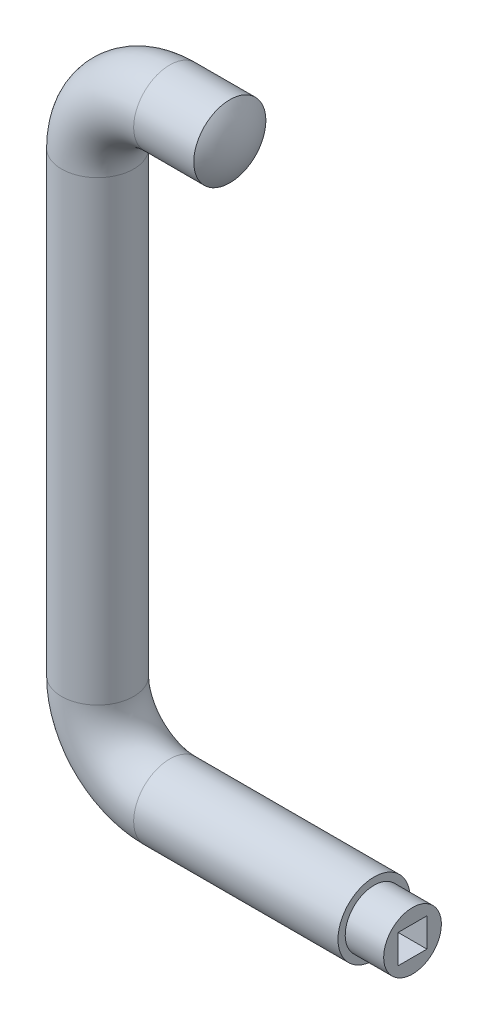
ISO-10303-21;
HEADER;
FILE_DESCRIPTION(('STEP AP214'),'2;1');
FILE_NAME('part.step','',(''),(''),'','','');
FILE_SCHEMA(('AUTOMOTIVE_DESIGN { 1 0 10303 214 1 1 1 1 }'));
ENDSEC;
DATA;
#1=APPLICATION_CONTEXT('core data for automotive mechanical design processes');
#2=APPLICATION_PROTOCOL_DEFINITION('international standard','automotive_design',2000,#1);
#3=PRODUCT_CONTEXT('',#1,'mechanical');
#4=PRODUCT('Part','Part','',(#3));
#5=PRODUCT_RELATED_PRODUCT_CATEGORY('part','',(#4));
#6=PRODUCT_DEFINITION_FORMATION('','',#4);
#7=PRODUCT_DEFINITION_CONTEXT('part definition',#1,'design');
#8=PRODUCT_DEFINITION('design','',#6,#7);
#9=PRODUCT_DEFINITION_SHAPE('','',#8);
#10=(LENGTH_UNIT() NAMED_UNIT(*) SI_UNIT(.MILLI.,.METRE.));
#11=(NAMED_UNIT(*) PLANE_ANGLE_UNIT() SI_UNIT($,.RADIAN.));
#12=(NAMED_UNIT(*) SI_UNIT($,.STERADIAN.) SOLID_ANGLE_UNIT());
#13=UNCERTAINTY_MEASURE_WITH_UNIT(LENGTH_MEASURE(1.E-05),#10,'distance_accuracy_value','');
#14=(GEOMETRIC_REPRESENTATION_CONTEXT(3) GLOBAL_UNCERTAINTY_ASSIGNED_CONTEXT((#13)) GLOBAL_UNIT_ASSIGNED_CONTEXT((#10,
#11,#12)) REPRESENTATION_CONTEXT('',''));
#15=CARTESIAN_POINT('',(0.,0.,0.));
#16=DIRECTION('',(0.,0.,1.));
#17=DIRECTION('',(1.,0.,0.));
#18=AXIS2_PLACEMENT_3D('',#15,#16,#17);
#19=CARTESIAN_POINT('',(-22.,132.5,0.));
#20=DIRECTION('',(1.,0.,0.));
#21=DIRECTION('',(0.,1.,0.));
#22=AXIS2_PLACEMENT_3D('',#19,#20,#21);
#23=PLANE('',#22);
#24=CARTESIAN_POINT('',(-22.,125.,0.));
#25=DIRECTION('',(-1.,0.,0.));
#26=DIRECTION('',(0.,0.,1.));
#27=AXIS2_PLACEMENT_3D('',#24,#25,#26);
#28=CIRCLE('',#27,6.);
#29=CARTESIAN_POINT('',(-22.,125.,6.));
#30=VERTEX_POINT('',#29);
#31=EDGE_CURVE('E145',#30,#30,#28,.T.);
#32=ORIENTED_EDGE('',*,*,#31,.T.);
#33=EDGE_LOOP('',(#32));
#34=FACE_BOUND('',#33,.T.);
#35=ADVANCED_FACE('F45',(#34),#23,.F.);
#36=CARTESIAN_POINT('',(-34.5,125.,0.));
#37=DIRECTION('',(1.,0.,0.));
#38=DIRECTION('',(0.,0.,-1.));
#39=AXIS2_PLACEMENT_3D('',#36,#37,#38);
#40=CYLINDRICAL_SURFACE('',#39,6.);
#41=ORIENTED_EDGE('',*,*,#31,.F.);
#42=EDGE_LOOP('',(#41));
#43=FACE_BOUND('',#42,.T.);
#44=CARTESIAN_POINT('',(-34.5,125.,0.));
#45=DIRECTION('',(-1.,0.,0.));
#46=DIRECTION('',(0.,-1.,0.));
#47=AXIS2_PLACEMENT_3D('',#44,#45,#46);
#48=CIRCLE('',#47,6.);
#49=CARTESIAN_POINT('',(-34.5,131.,0.));
#50=VERTEX_POINT('',#49);
#51=EDGE_CURVE('E142',#50,#50,#48,.T.);
#52=ORIENTED_EDGE('',*,*,#51,.T.);
#53=EDGE_LOOP('',(#52));
#54=FACE_BOUND('',#53,.T.);
#55=ADVANCED_FACE('F181',(#43,#54),#40,.F.);
#56=CARTESIAN_POINT('',(-34.5,110.,0.));
#57=DIRECTION('',(0.,0.,-1.));
#58=DIRECTION('',(-1.,0.,0.));
#59=AXIS2_PLACEMENT_3D('',#56,#57,#58);
#60=TOROIDAL_SURFACE('',#59,15.,6.);
#61=CARTESIAN_POINT('',(-49.5,110.,0.));
#62=DIRECTION('',(0.,1.,0.));
#63=DIRECTION('',(-1.,0.,0.));
#64=AXIS2_PLACEMENT_3D('',#61,#62,#63);
#65=CIRCLE('',#64,6.);
#66=CARTESIAN_POINT('',(-55.5,110.,0.));
#67=VERTEX_POINT('',#66);
#68=EDGE_CURVE('E139',#67,#67,#65,.F.);
#69=CARTESIAN_POINT('',(-34.5,110.,0.));
#70=DIRECTION('',(0.,0.,-1.));
#71=DIRECTION('',(-1.,0.,0.));
#72=AXIS2_PLACEMENT_3D('',#69,#70,#71);
#73=CIRCLE('',#72,21.);
#74=EDGE_CURVE('',#67,#50,#73,.T.);
#75=ORIENTED_EDGE('',*,*,#68,.T.);
#76=ORIENTED_EDGE('',*,*,#51,.F.);
#77=ORIENTED_EDGE('',*,*,#74,.T.);
#78=ORIENTED_EDGE('',*,*,#74,.F.);
#79=EDGE_LOOP('',(#75,#77,#76,#78));
#80=FACE_BOUND('',#79,.T.);
#81=ADVANCED_FACE('F187',(#80),#60,.F.);
#82=CARTESIAN_POINT('',(-49.5,15.,0.));
#83=DIRECTION('',(0.,1.,0.));
#84=DIRECTION('',(-1.,0.,0.));
#85=AXIS2_PLACEMENT_3D('',#82,#83,#84);
#86=CYLINDRICAL_SURFACE('',#85,6.);
#87=ORIENTED_EDGE('',*,*,#68,.F.);
#88=EDGE_LOOP('',(#87));
#89=FACE_BOUND('',#88,.T.);
#90=CARTESIAN_POINT('',(-49.5,15.,0.));
#91=DIRECTION('',(0.,-1.,0.));
#92=DIRECTION('',(1.,0.,0.));
#93=AXIS2_PLACEMENT_3D('',#90,#91,#92);
#94=CIRCLE('',#93,6.);
#95=CARTESIAN_POINT('',(-55.5,15.,0.));
#96=VERTEX_POINT('',#95);
#97=EDGE_CURVE('E136',#96,#96,#94,.T.);
#98=ORIENTED_EDGE('',*,*,#97,.T.);
#99=EDGE_LOOP('',(#98));
#100=FACE_BOUND('',#99,.T.);
#101=ADVANCED_FACE('F200',(#89,#100),#86,.F.);
#102=CARTESIAN_POINT('',(-34.5,15.,0.));
#103=DIRECTION('',(0.,0.,-1.));
#104=DIRECTION('',(-1.,0.,0.));
#105=AXIS2_PLACEMENT_3D('',#102,#103,#104);
#106=TOROIDAL_SURFACE('',#105,15.,6.);
#107=CARTESIAN_POINT('',(-34.5,0.,0.));
#108=DIRECTION('',(-1.,0.,0.));
#109=DIRECTION('',(0.,-1.,0.));
#110=AXIS2_PLACEMENT_3D('',#107,#108,#109);
#111=CIRCLE('',#110,6.);
#112=CARTESIAN_POINT('',(-34.5,-6.,0.));
#113=VERTEX_POINT('',#112);
#114=EDGE_CURVE('E133',#113,#113,#111,.F.);
#115=CARTESIAN_POINT('',(-34.5,15.,0.));
#116=DIRECTION('',(0.,0.,-1.));
#117=DIRECTION('',(-1.,0.,0.));
#118=AXIS2_PLACEMENT_3D('',#115,#116,#117);
#119=CIRCLE('',#118,21.);
#120=EDGE_CURVE('',#113,#96,#119,.T.);
#121=ORIENTED_EDGE('',*,*,#114,.T.);
#122=ORIENTED_EDGE('',*,*,#97,.F.);
#123=ORIENTED_EDGE('',*,*,#120,.T.);
#124=ORIENTED_EDGE('',*,*,#120,.F.);
#125=EDGE_LOOP('',(#121,#123,#122,#124));
#126=FACE_BOUND('',#125,.T.);
#127=ADVANCED_FACE('F196',(#126),#106,.F.);
#128=CARTESIAN_POINT('',(0.,0.,0.));
#129=DIRECTION('',(-1.,0.,0.));
#130=DIRECTION('',(0.,-1.,0.));
#131=AXIS2_PLACEMENT_3D('',#128,#129,#130);
#132=CYLINDRICAL_SURFACE('',#131,6.);
#133=ORIENTED_EDGE('',*,*,#114,.F.);
#134=EDGE_LOOP('',(#133));
#135=FACE_BOUND('',#134,.T.);
#136=CARTESIAN_POINT('',(0.,0.,0.));
#137=DIRECTION('',(1.,0.,0.));
#138=DIRECTION('',(0.,1.,0.));
#139=AXIS2_PLACEMENT_3D('',#136,#137,#138);
#140=CIRCLE('',#139,6.);
#141=CARTESIAN_POINT('',(0.,6.,0.));
#142=VERTEX_POINT('',#141);
#143=EDGE_CURVE('E129',#142,#142,#140,.T.);
#144=ORIENTED_EDGE('',*,*,#143,.T.);
#145=EDGE_LOOP('',(#144));
#146=FACE_BOUND('',#145,.T.);
#147=ADVANCED_FACE('F193',(#135,#146),#132,.F.);
#148=CARTESIAN_POINT('',(0.,0.,0.));
#149=DIRECTION('',(1.,0.,0.));
#150=DIRECTION('',(0.,1.,0.));
#151=AXIS2_PLACEMENT_3D('',#148,#149,#150);
#152=PLANE('',#151);
#153=DIRECTION('',(0.,0.,1.));
#154=VECTOR('',#153,1.);
#155=CARTESIAN_POINT('',(0.,3.,-3.));
#156=LINE('',#155,#154);
#157=CARTESIAN_POINT('',(0.,3.,-3.));
#158=VERTEX_POINT('',#157);
#159=CARTESIAN_POINT('',(0.,3.,3.));
#160=VERTEX_POINT('',#159);
#161=EDGE_CURVE('E95',#158,#160,#156,.T.);
#162=ORIENTED_EDGE('',*,*,#161,.T.);
#163=DIRECTION('',(0.,-1.,0.));
#164=VECTOR('',#163,1.);
#165=CARTESIAN_POINT('',(0.,-3.,3.));
#166=LINE('',#165,#164);
#167=CARTESIAN_POINT('',(0.,-3.,3.));
#168=VERTEX_POINT('',#167);
#169=EDGE_CURVE('E89',#160,#168,#166,.T.);
#170=ORIENTED_EDGE('',*,*,#169,.T.);
#171=DIRECTION('',(0.,0.,-1.));
#172=VECTOR('',#171,1.);
#173=CARTESIAN_POINT('',(0.,-3.,-3.));
#174=LINE('',#173,#172);
#175=CARTESIAN_POINT('',(0.,-3.,-3.));
#176=VERTEX_POINT('',#175);
#177=EDGE_CURVE('E98',#168,#176,#174,.T.);
#178=ORIENTED_EDGE('',*,*,#177,.T.);
#179=DIRECTION('',(0.,1.,0.));
#180=VECTOR('',#179,1.);
#181=CARTESIAN_POINT('',(0.,-3.,-3.));
#182=LINE('',#181,#180);
#183=EDGE_CURVE('E61',#176,#158,#182,.T.);
#184=ORIENTED_EDGE('',*,*,#183,.T.);
#185=EDGE_LOOP('',(#162,#170,#178,#184));
#186=FACE_BOUND('',#185,.T.);
#187=ORIENTED_EDGE('',*,*,#143,.F.);
#188=EDGE_LOOP('',(#187));
#189=FACE_BOUND('',#188,.T.);
#190=ADVANCED_FACE('F102',(#186,#189),#152,.F.);
#191=CARTESIAN_POINT('',(0.,-3.,3.));
#192=DIRECTION('',(0.,0.,1.));
#193=DIRECTION('',(1.,0.,0.));
#194=AXIS2_PLACEMENT_3D('',#191,#192,#193);
#195=PLANE('',#194);
#196=DIRECTION('',(0.,-1.,0.));
#197=VECTOR('',#196,1.);
#198=CARTESIAN_POINT('',(16.,-3.,3.));
#199=LINE('',#198,#197);
#200=CARTESIAN_POINT('',(16.,3.,3.));
#201=VERTEX_POINT('',#200);
#202=CARTESIAN_POINT('',(16.,-3.,3.));
#203=VERTEX_POINT('',#202);
#204=EDGE_CURVE('E69',#201,#203,#199,.T.);
#205=ORIENTED_EDGE('',*,*,#204,.T.);
#206=DIRECTION('',(1.,0.,0.));
#207=VECTOR('',#206,1.);
#208=CARTESIAN_POINT('',(0.,-3.,3.));
#209=LINE('',#208,#207);
#210=EDGE_CURVE('E85',#168,#203,#209,.T.);
#211=ORIENTED_EDGE('',*,*,#210,.F.);
#212=ORIENTED_EDGE('',*,*,#169,.F.);
#213=DIRECTION('',(1.,0.,0.));
#214=VECTOR('',#213,1.);
#215=CARTESIAN_POINT('',(0.,3.,3.));
#216=LINE('',#215,#214);
#217=EDGE_CURVE('E118',#160,#201,#216,.T.);
#218=ORIENTED_EDGE('',*,*,#217,.T.);
#219=EDGE_LOOP('',(#205,#211,#212,#218));
#220=FACE_BOUND('',#219,.T.);
#221=ADVANCED_FACE('F87',(#220),#195,.F.);
#222=CARTESIAN_POINT('',(0.,3.,-3.));
#223=DIRECTION('',(0.,1.,0.));
#224=DIRECTION('',(0.,0.,1.));
#225=AXIS2_PLACEMENT_3D('',#222,#223,#224);
#226=PLANE('',#225);
#227=DIRECTION('',(0.,0.,1.));
#228=VECTOR('',#227,1.);
#229=CARTESIAN_POINT('',(16.,3.,-3.));
#230=LINE('',#229,#228);
#231=CARTESIAN_POINT('',(16.,3.,-3.));
#232=VERTEX_POINT('',#231);
#233=EDGE_CURVE('E105',#232,#201,#230,.T.);
#234=ORIENTED_EDGE('',*,*,#233,.T.);
#235=ORIENTED_EDGE('',*,*,#217,.F.);
#236=ORIENTED_EDGE('',*,*,#161,.F.);
#237=DIRECTION('',(1.,0.,0.));
#238=VECTOR('',#237,1.);
#239=CARTESIAN_POINT('',(0.,3.,-3.));
#240=LINE('',#239,#238);
#241=EDGE_CURVE('E121',#158,#232,#240,.T.);
#242=ORIENTED_EDGE('',*,*,#241,.T.);
#243=EDGE_LOOP('',(#234,#235,#236,#242));
#244=FACE_BOUND('',#243,.T.);
#245=ADVANCED_FACE('F240',(#244),#226,.F.);
#246=CARTESIAN_POINT('',(0.,-3.,-3.));
#247=DIRECTION('',(0.,0.,-1.));
#248=DIRECTION('',(-1.,0.,0.));
#249=AXIS2_PLACEMENT_3D('',#246,#247,#248);
#250=PLANE('',#249);
#251=DIRECTION('',(0.,1.,0.));
#252=VECTOR('',#251,1.);
#253=CARTESIAN_POINT('',(16.,-3.,-3.));
#254=LINE('',#253,#252);
#255=CARTESIAN_POINT('',(16.,-3.,-3.));
#256=VERTEX_POINT('',#255);
#257=EDGE_CURVE('E108',#256,#232,#254,.T.);
#258=ORIENTED_EDGE('',*,*,#257,.T.);
#259=ORIENTED_EDGE('',*,*,#241,.F.);
#260=ORIENTED_EDGE('',*,*,#183,.F.);
#261=DIRECTION('',(1.,0.,0.));
#262=VECTOR('',#261,1.);
#263=CARTESIAN_POINT('',(0.,-3.,-3.));
#264=LINE('',#263,#262);
#265=EDGE_CURVE('E94',#176,#256,#264,.T.);
#266=ORIENTED_EDGE('',*,*,#265,.T.);
#267=EDGE_LOOP('',(#258,#259,#260,#266));
#268=FACE_BOUND('',#267,.T.);
#269=ADVANCED_FACE('F178',(#268),#250,.F.);
#270=CARTESIAN_POINT('',(0.,-3.,-3.));
#271=DIRECTION('',(0.,-1.,0.));
#272=DIRECTION('',(0.,0.,-1.));
#273=AXIS2_PLACEMENT_3D('',#270,#271,#272);
#274=PLANE('',#273);
#275=DIRECTION('',(0.,0.,-1.));
#276=VECTOR('',#275,1.);
#277=CARTESIAN_POINT('',(16.,-3.,-3.));
#278=LINE('',#277,#276);
#279=EDGE_CURVE('E114',#203,#256,#278,.T.);
#280=ORIENTED_EDGE('',*,*,#279,.T.);
#281=ORIENTED_EDGE('',*,*,#265,.F.);
#282=ORIENTED_EDGE('',*,*,#177,.F.);
#283=ORIENTED_EDGE('',*,*,#210,.T.);
#284=EDGE_LOOP('',(#280,#281,#282,#283));
#285=FACE_BOUND('',#284,.T.);
#286=ADVANCED_FACE('F99',(#285),#274,.F.);
#287=CARTESIAN_POINT('',(0.,0.,0.));
#288=DIRECTION('',(-1.,0.,0.));
#289=DIRECTION('',(0.,-1.,0.));
#290=AXIS2_PLACEMENT_3D('',#287,#288,#289);
#291=CYLINDRICAL_SURFACE('',#290,7.5);
#292=CARTESIAN_POINT('',(-34.5,0.,0.));
#293=DIRECTION('',(1.,0.,0.));
#294=DIRECTION('',(0.,0.,1.));
#295=AXIS2_PLACEMENT_3D('',#292,#293,#294);
#296=CIRCLE('',#295,7.5);
#297=CARTESIAN_POINT('',(-34.5,-7.5,0.));
#298=VERTEX_POINT('',#297);
#299=EDGE_CURVE('E150',#298,#298,#296,.T.);
#300=ORIENTED_EDGE('',*,*,#299,.T.);
#301=EDGE_LOOP('',(#300));
#302=FACE_BOUND('',#301,.T.);
#303=CARTESIAN_POINT('',(8.,0.,0.));
#304=DIRECTION('',(1.,0.,0.));
#305=DIRECTION('',(0.,1.,0.));
#306=AXIS2_PLACEMENT_3D('',#303,#304,#305);
#307=CIRCLE('',#306,7.5);
#308=CARTESIAN_POINT('',(8.,7.5,0.));
#309=VERTEX_POINT('',#308);
#310=EDGE_CURVE('E125',#309,#309,#307,.T.);
#311=ORIENTED_EDGE('',*,*,#310,.F.);
#312=EDGE_LOOP('',(#311));
#313=FACE_BOUND('',#312,.T.);
#314=ADVANCED_FACE('F175',(#302,#313),#291,.T.);
#315=CARTESIAN_POINT('',(-34.5,15.,0.));
#316=DIRECTION('',(0.,0.,-1.));
#317=DIRECTION('',(-1.,0.,0.));
#318=AXIS2_PLACEMENT_3D('',#315,#316,#317);
#319=TOROIDAL_SURFACE('',#318,15.,7.5);
#320=CARTESIAN_POINT('',(-49.5,15.,0.));
#321=DIRECTION('',(0.,-1.,0.));
#322=DIRECTION('',(0.,0.,1.));
#323=AXIS2_PLACEMENT_3D('',#320,#321,#322);
#324=CIRCLE('',#323,7.5);
#325=CARTESIAN_POINT('',(-57.,15.,0.));
#326=VERTEX_POINT('',#325);
#327=EDGE_CURVE('E153',#326,#326,#324,.T.);
#328=CARTESIAN_POINT('',(-34.5,15.,0.));
#329=DIRECTION('',(0.,0.,-1.));
#330=DIRECTION('',(-1.,0.,0.));
#331=AXIS2_PLACEMENT_3D('',#328,#329,#330);
#332=CIRCLE('',#331,22.5);
#333=EDGE_CURVE('',#298,#326,#332,.T.);
#334=ORIENTED_EDGE('',*,*,#299,.F.);
#335=ORIENTED_EDGE('',*,*,#327,.T.);
#336=ORIENTED_EDGE('',*,*,#333,.T.);
#337=ORIENTED_EDGE('',*,*,#333,.F.);
#338=EDGE_LOOP('',(#334,#336,#335,#337));
#339=FACE_BOUND('',#338,.T.);
#340=ADVANCED_FACE('F210',(#339),#319,.T.);
#341=CARTESIAN_POINT('',(-49.5,15.,0.));
#342=DIRECTION('',(0.,1.,0.));
#343=DIRECTION('',(-1.,0.,0.));
#344=AXIS2_PLACEMENT_3D('',#341,#342,#343);
#345=CYLINDRICAL_SURFACE('',#344,7.5);
#346=CARTESIAN_POINT('',(-49.5,110.,0.));
#347=DIRECTION('',(0.,-1.,0.));
#348=DIRECTION('',(0.,0.,1.));
#349=AXIS2_PLACEMENT_3D('',#346,#347,#348);
#350=CIRCLE('',#349,7.5);
#351=CARTESIAN_POINT('',(-57.,110.,0.));
#352=VERTEX_POINT('',#351);
#353=EDGE_CURVE('E155',#352,#352,#350,.T.);
#354=ORIENTED_EDGE('',*,*,#353,.T.);
#355=EDGE_LOOP('',(#354));
#356=FACE_BOUND('',#355,.T.);
#357=ORIENTED_EDGE('',*,*,#327,.F.);
#358=EDGE_LOOP('',(#357));
#359=FACE_BOUND('',#358,.T.);
#360=ADVANCED_FACE('F176',(#356,#359),#345,.T.);
#361=CARTESIAN_POINT('',(-34.5,110.,0.));
#362=DIRECTION('',(0.,0.,-1.));
#363=DIRECTION('',(-1.,0.,0.));
#364=AXIS2_PLACEMENT_3D('',#361,#362,#363);
#365=TOROIDAL_SURFACE('',#364,15.,7.5);
#366=CARTESIAN_POINT('',(-34.5,125.,0.));
#367=DIRECTION('',(-1.,0.,0.));
#368=DIRECTION('',(0.,0.,1.));
#369=AXIS2_PLACEMENT_3D('',#366,#367,#368);
#370=CIRCLE('',#369,7.5);
#371=CARTESIAN_POINT('',(-34.5,132.5,0.));
#372=VERTEX_POINT('',#371);
#373=EDGE_CURVE('E49',#372,#372,#370,.T.);
#374=CARTESIAN_POINT('',(-34.5,110.,0.));
#375=DIRECTION('',(0.,0.,-1.));
#376=DIRECTION('',(-1.,0.,0.));
#377=AXIS2_PLACEMENT_3D('',#374,#375,#376);
#378=CIRCLE('',#377,22.5);
#379=EDGE_CURVE('',#352,#372,#378,.T.);
#380=ORIENTED_EDGE('',*,*,#353,.F.);
#381=ORIENTED_EDGE('',*,*,#373,.T.);
#382=ORIENTED_EDGE('',*,*,#379,.T.);
#383=ORIENTED_EDGE('',*,*,#379,.F.);
#384=EDGE_LOOP('',(#380,#382,#381,#383));
#385=FACE_BOUND('',#384,.T.);
#386=ADVANCED_FACE('F162',(#385),#365,.T.);
#387=CARTESIAN_POINT('',(-34.5,125.,0.));
#388=DIRECTION('',(1.,0.,0.));
#389=DIRECTION('',(0.,0.,-1.));
#390=AXIS2_PLACEMENT_3D('',#387,#388,#389);
#391=CYLINDRICAL_SURFACE('',#390,7.5);
#392=CARTESIAN_POINT('',(-21.9999999999999,125.,0.));
#393=DIRECTION('',(-1.,0.,0.));
#394=DIRECTION('',(0.,-1.,0.));
#395=AXIS2_PLACEMENT_3D('',#392,#393,#394);
#396=CIRCLE('',#395,7.50000000000001);
#397=CARTESIAN_POINT('',(-21.9999999999998,117.5,0.));
#398=VERTEX_POINT('',#397);
#399=EDGE_CURVE('E130',#398,#398,#396,.T.);
#400=ORIENTED_EDGE('',*,*,#399,.T.);
#401=EDGE_LOOP('',(#400));
#402=FACE_BOUND('',#401,.T.);
#403=ORIENTED_EDGE('',*,*,#373,.F.);
#404=EDGE_LOOP('',(#403));
#405=FACE_BOUND('',#404,.T.);
#406=ADVANCED_FACE('F47',(#402,#405),#391,.T.);
#407=CARTESIAN_POINT('',(-32.,125.,0.));
#408=DIRECTION('',(-1.,0.,0.));
#409=DIRECTION('',(0.,-1.,0.));
#410=AXIS2_PLACEMENT_3D('',#407,#408,#409);
#411=SPHERICAL_SURFACE('',#410,12.5);
#412=ORIENTED_EDGE('',*,*,#399,.F.);
#413=EDGE_LOOP('',(#412));
#414=FACE_BOUND('',#413,.T.);
#415=ADVANCED_FACE('F166',(#414),#411,.T.);
#416=CARTESIAN_POINT('',(8.,0.,0.));
#417=DIRECTION('',(1.,0.,0.));
#418=DIRECTION('',(0.,1.,0.));
#419=AXIS2_PLACEMENT_3D('',#416,#417,#418);
#420=PLANE('',#419);
#421=CARTESIAN_POINT('',(8.,0.,0.));
#422=DIRECTION('',(1.,0.,0.));
#423=DIRECTION('',(0.,1.,0.));
#424=AXIS2_PLACEMENT_3D('',#421,#422,#423);
#425=CIRCLE('',#424,6.);
#426=CARTESIAN_POINT('',(8.,6.,0.));
#427=VERTEX_POINT('',#426);
#428=EDGE_CURVE('E12',#427,#427,#425,.T.);
#429=ORIENTED_EDGE('',*,*,#428,.F.);
#430=EDGE_LOOP('',(#429));
#431=FACE_BOUND('',#430,.T.);
#432=ORIENTED_EDGE('',*,*,#310,.T.);
#433=EDGE_LOOP('',(#432));
#434=FACE_BOUND('',#433,.T.);
#435=ADVANCED_FACE('F172',(#431,#434),#420,.T.);
#436=CARTESIAN_POINT('',(16.,0.,0.));
#437=DIRECTION('',(-1.,0.,0.));
#438=DIRECTION('',(0.,-1.,0.));
#439=AXIS2_PLACEMENT_3D('',#436,#437,#438);
#440=CYLINDRICAL_SURFACE('',#439,6.);
#441=CARTESIAN_POINT('',(16.,0.,0.));
#442=DIRECTION('',(1.,0.,0.));
#443=DIRECTION('',(0.,1.,0.));
#444=AXIS2_PLACEMENT_3D('',#441,#442,#443);
#445=CIRCLE('',#444,6.);
#446=CARTESIAN_POINT('',(16.,6.,0.));
#447=VERTEX_POINT('',#446);
#448=EDGE_CURVE('E120',#447,#447,#445,.T.);
#449=ORIENTED_EDGE('',*,*,#448,.F.);
#450=EDGE_LOOP('',(#449));
#451=FACE_BOUND('',#450,.T.);
#452=ORIENTED_EDGE('',*,*,#428,.T.);
#453=EDGE_LOOP('',(#452));
#454=FACE_BOUND('',#453,.T.);
#455=ADVANCED_FACE('F226',(#451,#454),#440,.T.);
#456=CARTESIAN_POINT('',(16.,0.,0.));
#457=DIRECTION('',(1.,0.,0.));
#458=DIRECTION('',(0.,1.,0.));
#459=AXIS2_PLACEMENT_3D('',#456,#457,#458);
#460=PLANE('',#459);
#461=ORIENTED_EDGE('',*,*,#204,.F.);
#462=ORIENTED_EDGE('',*,*,#233,.F.);
#463=ORIENTED_EDGE('',*,*,#257,.F.);
#464=ORIENTED_EDGE('',*,*,#279,.F.);
#465=EDGE_LOOP('',(#461,#462,#463,#464));
#466=FACE_BOUND('',#465,.T.);
#467=ORIENTED_EDGE('',*,*,#448,.T.);
#468=EDGE_LOOP('',(#467));
#469=FACE_BOUND('',#468,.T.);
#470=ADVANCED_FACE('F231',(#466,#469),#460,.T.);
#471=CLOSED_SHELL('',(#35,#55,#81,#101,#127,#147,#190,#221,#245,#269,#286,#314,#340,#360,#386,
#406,#415,#435,#455,#470));
#472=MANIFOLD_SOLID_BREP('B2',#471);
#473=ADVANCED_BREP_SHAPE_REPRESENTATION('',(#18,#472),#14);
#474=SHAPE_DEFINITION_REPRESENTATION(#9,#473);
ENDSEC;
END-ISO-10303-21;
